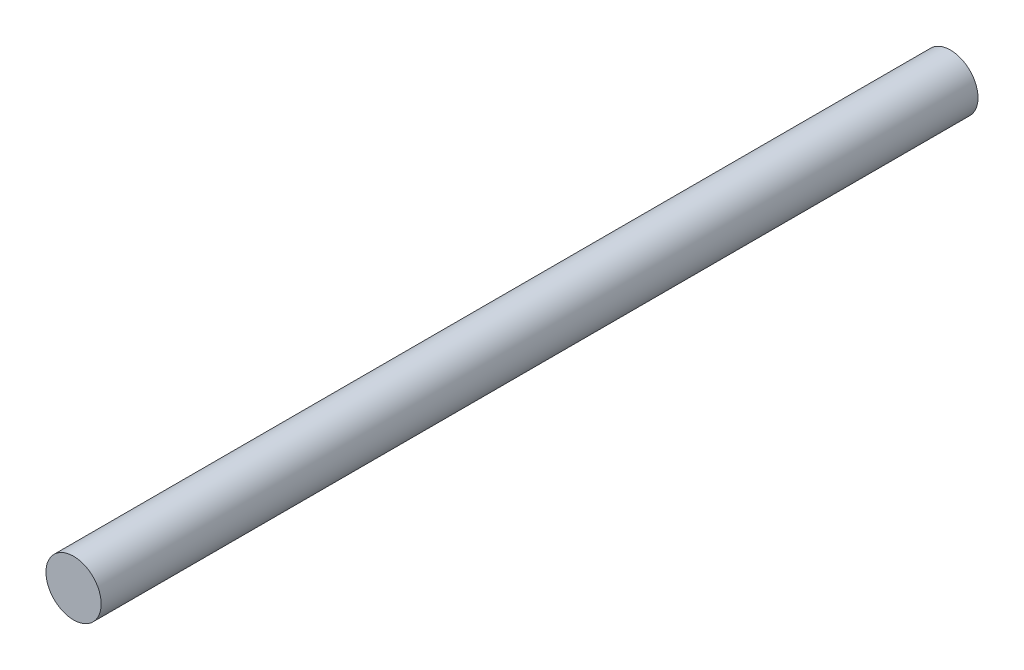
ISO-10303-21;
HEADER;
FILE_DESCRIPTION(('STEP AP214'),'2;1');
FILE_NAME('part.step','',(''),(''),'','','');
FILE_SCHEMA(('AUTOMOTIVE_DESIGN { 1 0 10303 214 1 1 1 1 }'));
ENDSEC;
DATA;
#1=APPLICATION_CONTEXT('core data for automotive mechanical design processes');
#2=APPLICATION_PROTOCOL_DEFINITION('international standard','automotive_design',2000,#1);
#3=PRODUCT_CONTEXT('',#1,'mechanical');
#4=PRODUCT('Part','Part','',(#3));
#5=PRODUCT_RELATED_PRODUCT_CATEGORY('part','',(#4));
#6=PRODUCT_DEFINITION_FORMATION('','',#4);
#7=PRODUCT_DEFINITION_CONTEXT('part definition',#1,'design');
#8=PRODUCT_DEFINITION('design','',#6,#7);
#9=PRODUCT_DEFINITION_SHAPE('','',#8);
#10=(LENGTH_UNIT() NAMED_UNIT(*) SI_UNIT(.MILLI.,.METRE.));
#11=(NAMED_UNIT(*) PLANE_ANGLE_UNIT() SI_UNIT($,.RADIAN.));
#12=(NAMED_UNIT(*) SI_UNIT($,.STERADIAN.) SOLID_ANGLE_UNIT());
#13=UNCERTAINTY_MEASURE_WITH_UNIT(LENGTH_MEASURE(1.E-05),#10,'distance_accuracy_value','');
#14=(GEOMETRIC_REPRESENTATION_CONTEXT(3) GLOBAL_UNCERTAINTY_ASSIGNED_CONTEXT((#13)) GLOBAL_UNIT_ASSIGNED_CONTEXT((#10,
#11,#12)) REPRESENTATION_CONTEXT('',''));
#15=CARTESIAN_POINT('',(0.,0.,0.));
#16=DIRECTION('',(0.,0.,1.));
#17=DIRECTION('',(1.,0.,0.));
#18=AXIS2_PLACEMENT_3D('',#15,#16,#17);
#19=CARTESIAN_POINT('',(0.,0.,63.5));
#20=DIRECTION('',(0.,0.,-1.));
#21=DIRECTION('',(-1.,0.,0.));
#22=AXIS2_PLACEMENT_3D('',#19,#20,#21);
#23=CYLINDRICAL_SURFACE('',#22,2.);
#24=CARTESIAN_POINT('',(0.,0.,63.5));
#25=DIRECTION('',(0.,0.,1.));
#26=DIRECTION('',(1.,0.,0.));
#27=AXIS2_PLACEMENT_3D('',#24,#25,#26);
#28=CIRCLE('',#27,2.);
#29=CARTESIAN_POINT('',(2.,0.,63.5));
#30=VERTEX_POINT('',#29);
#31=EDGE_CURVE('E10',#30,#30,#28,.T.);
#32=ORIENTED_EDGE('',*,*,#31,.F.);
#33=EDGE_LOOP('',(#32));
#34=FACE_BOUND('',#33,.T.);
#35=CARTESIAN_POINT('',(0.,0.,0.));
#36=DIRECTION('',(0.,0.,1.));
#37=DIRECTION('',(1.,0.,0.));
#38=AXIS2_PLACEMENT_3D('',#35,#36,#37);
#39=CIRCLE('',#38,2.);
#40=CARTESIAN_POINT('',(2.,0.,0.));
#41=VERTEX_POINT('',#40);
#42=EDGE_CURVE('E44',#41,#41,#39,.T.);
#43=ORIENTED_EDGE('',*,*,#42,.T.);
#44=EDGE_LOOP('',(#43));
#45=FACE_BOUND('',#44,.T.);
#46=ADVANCED_FACE('F41',(#34,#45),#23,.T.);
#47=CARTESIAN_POINT('',(0.,0.,63.5));
#48=DIRECTION('',(0.,0.,1.));
#49=DIRECTION('',(1.,0.,0.));
#50=AXIS2_PLACEMENT_3D('',#47,#48,#49);
#51=PLANE('',#50);
#52=ORIENTED_EDGE('',*,*,#31,.T.);
#53=EDGE_LOOP('',(#52));
#54=FACE_BOUND('',#53,.T.);
#55=ADVANCED_FACE('F58',(#54),#51,.T.);
#56=CARTESIAN_POINT('',(0.,0.,0.));
#57=DIRECTION('',(0.,0.,1.));
#58=DIRECTION('',(1.,0.,0.));
#59=AXIS2_PLACEMENT_3D('',#56,#57,#58);
#60=PLANE('',#59);
#61=ORIENTED_EDGE('',*,*,#42,.F.);
#62=EDGE_LOOP('',(#61));
#63=FACE_BOUND('',#62,.T.);
#64=ADVANCED_FACE('F56',(#63),#60,.F.);
#65=CLOSED_SHELL('',(#46,#55,#64));
#66=MANIFOLD_SOLID_BREP('B2',#65);
#67=ADVANCED_BREP_SHAPE_REPRESENTATION('',(#18,#66),#14);
#68=SHAPE_DEFINITION_REPRESENTATION(#9,#67);
ENDSEC;
END-ISO-10303-21;
